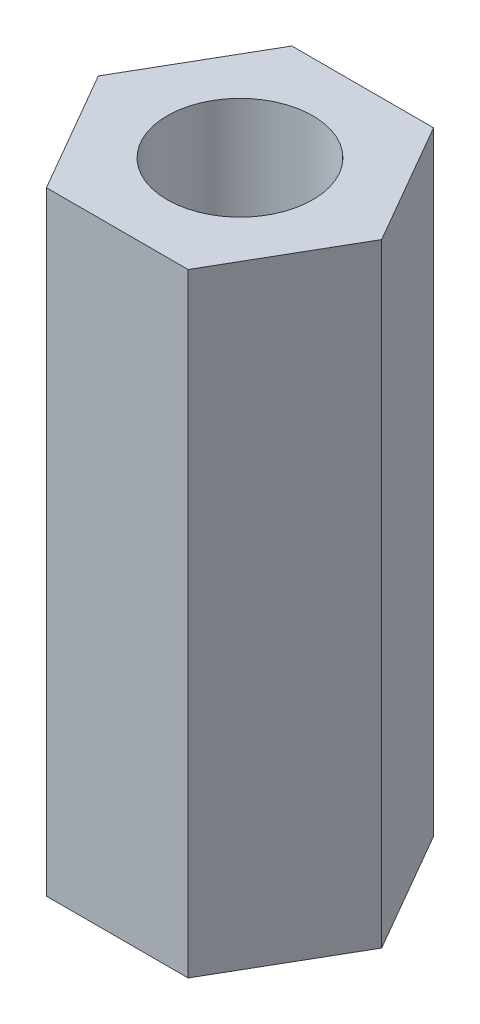
ISO-10303-21;
HEADER;
FILE_DESCRIPTION(('STEP AP214'),'2;1');
FILE_NAME('part.step','',(''),(''),'','','');
FILE_SCHEMA(('AUTOMOTIVE_DESIGN { 1 0 10303 214 1 1 1 1 }'));
ENDSEC;
DATA;
#1=APPLICATION_CONTEXT('core data for automotive mechanical design processes');
#2=APPLICATION_PROTOCOL_DEFINITION('international standard','automotive_design',2000,#1);
#3=PRODUCT_CONTEXT('',#1,'mechanical');
#4=PRODUCT('Part','Part','',(#3));
#5=PRODUCT_RELATED_PRODUCT_CATEGORY('part','',(#4));
#6=PRODUCT_DEFINITION_FORMATION('','',#4);
#7=PRODUCT_DEFINITION_CONTEXT('part definition',#1,'design');
#8=PRODUCT_DEFINITION('design','',#6,#7);
#9=PRODUCT_DEFINITION_SHAPE('','',#8);
#10=(LENGTH_UNIT() NAMED_UNIT(*) SI_UNIT(.MILLI.,.METRE.));
#11=(NAMED_UNIT(*) PLANE_ANGLE_UNIT() SI_UNIT($,.RADIAN.));
#12=(NAMED_UNIT(*) SI_UNIT($,.STERADIAN.) SOLID_ANGLE_UNIT());
#13=UNCERTAINTY_MEASURE_WITH_UNIT(LENGTH_MEASURE(1.E-05),#10,'distance_accuracy_value','');
#14=(GEOMETRIC_REPRESENTATION_CONTEXT(3) GLOBAL_UNCERTAINTY_ASSIGNED_CONTEXT((#13)) GLOBAL_UNIT_ASSIGNED_CONTEXT((#10,
#11,#12)) REPRESENTATION_CONTEXT('',''));
#15=CARTESIAN_POINT('',(0.,0.,0.));
#16=DIRECTION('',(0.,0.,1.));
#17=DIRECTION('',(1.,0.,0.));
#18=AXIS2_PLACEMENT_3D('',#15,#16,#17);
#19=CARTESIAN_POINT('',(0.,9.525,0.));
#20=DIRECTION('',(0.,1.,0.));
#21=DIRECTION('',(0.,0.,1.));
#22=AXIS2_PLACEMENT_3D('',#19,#20,#21);
#23=PLANE('',#22);
#24=DIRECTION('',(1.,0.,0.));
#25=VECTOR('',#24,1.);
#26=CARTESIAN_POINT('',(-1.09985226280624,9.525,1.905));
#27=LINE('',#26,#25);
#28=CARTESIAN_POINT('',(-1.09985226280624,9.525,1.905));
#29=VERTEX_POINT('',#28);
#30=CARTESIAN_POINT('',(1.09985226280624,9.525,1.905));
#31=VERTEX_POINT('',#30);
#32=EDGE_CURVE('E129',#29,#31,#27,.T.);
#33=ORIENTED_EDGE('',*,*,#32,.T.);
#34=DIRECTION('',(0.5,0.,-0.866025403784439));
#35=VECTOR('',#34,1.);
#36=CARTESIAN_POINT('',(1.09985226280624,9.525,1.905));
#37=LINE('',#36,#35);
#38=CARTESIAN_POINT('',(2.19970452561247,9.525,0.));
#39=VERTEX_POINT('',#38);
#40=EDGE_CURVE('E87',#31,#39,#37,.T.);
#41=ORIENTED_EDGE('',*,*,#40,.T.);
#42=DIRECTION('',(-0.5,0.,-0.866025403784439));
#43=VECTOR('',#42,1.);
#44=CARTESIAN_POINT('',(2.19970452561247,9.525,0.));
#45=LINE('',#44,#43);
#46=CARTESIAN_POINT('',(1.09985226280624,9.525,-1.905));
#47=VERTEX_POINT('',#46);
#48=EDGE_CURVE('E100',#39,#47,#45,.T.);
#49=ORIENTED_EDGE('',*,*,#48,.T.);
#50=DIRECTION('',(-1.,0.,0.));
#51=VECTOR('',#50,1.);
#52=CARTESIAN_POINT('',(1.09985226280624,9.525,-1.905));
#53=LINE('',#52,#51);
#54=CARTESIAN_POINT('',(-1.09985226280624,9.525,-1.905));
#55=VERTEX_POINT('',#54);
#56=EDGE_CURVE('E94',#47,#55,#53,.T.);
#57=ORIENTED_EDGE('',*,*,#56,.T.);
#58=DIRECTION('',(-0.5,0.,0.866025403784439));
#59=VECTOR('',#58,1.);
#60=CARTESIAN_POINT('',(-1.09985226280624,9.525,-1.905));
#61=LINE('',#60,#59);
#62=CARTESIAN_POINT('',(-2.19970452561247,9.525,0.));
#63=VERTEX_POINT('',#62);
#64=EDGE_CURVE('E98',#55,#63,#61,.T.);
#65=ORIENTED_EDGE('',*,*,#64,.T.);
#66=DIRECTION('',(0.5,0.,0.866025403784439));
#67=VECTOR('',#66,1.);
#68=CARTESIAN_POINT('',(-2.19970452561247,9.525,0.));
#69=LINE('',#68,#67);
#70=EDGE_CURVE('E50',#63,#29,#69,.T.);
#71=ORIENTED_EDGE('',*,*,#70,.T.);
#72=EDGE_LOOP('',(#33,#41,#49,#57,#65,#71));
#73=FACE_BOUND('',#72,.T.);
#74=CARTESIAN_POINT('',(0.,9.525,0.));
#75=DIRECTION('',(0.,1.,0.));
#76=DIRECTION('',(0.,0.,1.));
#77=AXIS2_PLACEMENT_3D('',#74,#75,#76);
#78=CIRCLE('',#77,1.1303);
#79=CARTESIAN_POINT('',(0.,9.525,1.1303));
#80=VERTEX_POINT('',#79);
#81=EDGE_CURVE('E122',#80,#80,#78,.T.);
#82=ORIENTED_EDGE('',*,*,#81,.F.);
#83=EDGE_LOOP('',(#82));
#84=FACE_BOUND('',#83,.T.);
#85=ADVANCED_FACE('F33',(#73,#84),#23,.T.);
#86=CARTESIAN_POINT('',(0.,0.,0.));
#87=DIRECTION('',(0.,1.,0.));
#88=DIRECTION('',(0.,0.,1.));
#89=AXIS2_PLACEMENT_3D('',#86,#87,#88);
#90=PLANE('',#89);
#91=DIRECTION('',(1.,0.,0.));
#92=VECTOR('',#91,1.);
#93=CARTESIAN_POINT('',(-1.09985226280624,0.,1.905));
#94=LINE('',#93,#92);
#95=CARTESIAN_POINT('',(-1.09985226280624,0.,1.905));
#96=VERTEX_POINT('',#95);
#97=CARTESIAN_POINT('',(1.09985226280624,0.,1.905));
#98=VERTEX_POINT('',#97);
#99=EDGE_CURVE('E118',#96,#98,#94,.T.);
#100=ORIENTED_EDGE('',*,*,#99,.F.);
#101=DIRECTION('',(0.5,0.,0.866025403784439));
#102=VECTOR('',#101,1.);
#103=CARTESIAN_POINT('',(-2.19970452561247,0.,0.));
#104=LINE('',#103,#102);
#105=CARTESIAN_POINT('',(-2.19970452561247,0.,0.));
#106=VERTEX_POINT('',#105);
#107=EDGE_CURVE('E79',#106,#96,#104,.T.);
#108=ORIENTED_EDGE('',*,*,#107,.F.);
#109=DIRECTION('',(-0.5,0.,0.866025403784439));
#110=VECTOR('',#109,1.);
#111=CARTESIAN_POINT('',(-1.09985226280624,0.,-1.905));
#112=LINE('',#111,#110);
#113=CARTESIAN_POINT('',(-1.09985226280624,0.,-1.905));
#114=VERTEX_POINT('',#113);
#115=EDGE_CURVE('E73',#114,#106,#112,.T.);
#116=ORIENTED_EDGE('',*,*,#115,.F.);
#117=DIRECTION('',(-1.,0.,0.));
#118=VECTOR('',#117,1.);
#119=CARTESIAN_POINT('',(1.09985226280624,0.,-1.905));
#120=LINE('',#119,#118);
#121=CARTESIAN_POINT('',(1.09985226280624,0.,-1.905));
#122=VERTEX_POINT('',#121);
#123=EDGE_CURVE('E108',#122,#114,#120,.T.);
#124=ORIENTED_EDGE('',*,*,#123,.F.);
#125=DIRECTION('',(-0.5,0.,-0.866025403784439));
#126=VECTOR('',#125,1.);
#127=CARTESIAN_POINT('',(2.19970452561247,0.,0.));
#128=LINE('',#127,#126);
#129=CARTESIAN_POINT('',(2.19970452561247,0.,0.));
#130=VERTEX_POINT('',#129);
#131=EDGE_CURVE('E124',#130,#122,#128,.T.);
#132=ORIENTED_EDGE('',*,*,#131,.F.);
#133=DIRECTION('',(0.5,0.,-0.866025403784439));
#134=VECTOR('',#133,1.);
#135=CARTESIAN_POINT('',(1.09985226280624,0.,1.905));
#136=LINE('',#135,#134);
#137=EDGE_CURVE('E121',#98,#130,#136,.T.);
#138=ORIENTED_EDGE('',*,*,#137,.F.);
#139=EDGE_LOOP('',(#100,#108,#116,#124,#132,#138));
#140=FACE_BOUND('',#139,.T.);
#141=CARTESIAN_POINT('',(0.,0.,0.));
#142=DIRECTION('',(0.,1.,0.));
#143=DIRECTION('',(0.,0.,1.));
#144=AXIS2_PLACEMENT_3D('',#141,#142,#143);
#145=CIRCLE('',#144,1.1303);
#146=CARTESIAN_POINT('',(0.,0.,1.1303));
#147=VERTEX_POINT('',#146);
#148=EDGE_CURVE('E222',#147,#147,#145,.T.);
#149=ORIENTED_EDGE('',*,*,#148,.T.);
#150=EDGE_LOOP('',(#149));
#151=FACE_BOUND('',#150,.T.);
#152=ADVANCED_FACE('F138',(#140,#151),#90,.F.);
#153=CARTESIAN_POINT('',(-1.09985226280624,9.525,1.905));
#154=DIRECTION('',(0.,0.,-1.));
#155=DIRECTION('',(-1.,0.,0.));
#156=AXIS2_PLACEMENT_3D('',#153,#154,#155);
#157=PLANE('',#156);
#158=ORIENTED_EDGE('',*,*,#99,.T.);
#159=DIRECTION('',(0.,-1.,0.));
#160=VECTOR('',#159,1.);
#161=CARTESIAN_POINT('',(1.09985226280624,9.525,1.905));
#162=LINE('',#161,#160);
#163=EDGE_CURVE('E11',#31,#98,#162,.T.);
#164=ORIENTED_EDGE('',*,*,#163,.F.);
#165=ORIENTED_EDGE('',*,*,#32,.F.);
#166=DIRECTION('',(0.,-1.,0.));
#167=VECTOR('',#166,1.);
#168=CARTESIAN_POINT('',(-1.09985226280624,9.525,1.905));
#169=LINE('',#168,#167);
#170=EDGE_CURVE('E114',#29,#96,#169,.T.);
#171=ORIENTED_EDGE('',*,*,#170,.T.);
#172=EDGE_LOOP('',(#158,#164,#165,#171));
#173=FACE_BOUND('',#172,.T.);
#174=ADVANCED_FACE('F35',(#173),#157,.F.);
#175=CARTESIAN_POINT('',(1.09985226280624,9.525,1.905));
#176=DIRECTION('',(-0.866025403784439,0.,-0.5));
#177=DIRECTION('',(-0.5,0.,0.866025403784439));
#178=AXIS2_PLACEMENT_3D('',#175,#176,#177);
#179=PLANE('',#178);
#180=ORIENTED_EDGE('',*,*,#137,.T.);
#181=DIRECTION('',(0.,-1.,0.));
#182=VECTOR('',#181,1.);
#183=CARTESIAN_POINT('',(2.19970452561247,9.525,0.));
#184=LINE('',#183,#182);
#185=EDGE_CURVE('E42',#39,#130,#184,.T.);
#186=ORIENTED_EDGE('',*,*,#185,.F.);
#187=ORIENTED_EDGE('',*,*,#40,.F.);
#188=ORIENTED_EDGE('',*,*,#163,.T.);
#189=EDGE_LOOP('',(#180,#186,#187,#188));
#190=FACE_BOUND('',#189,.T.);
#191=ADVANCED_FACE('F163',(#190),#179,.F.);
#192=CARTESIAN_POINT('',(2.19970452561247,9.525,0.));
#193=DIRECTION('',(-0.866025403784439,0.,0.5));
#194=DIRECTION('',(0.5,0.,0.866025403784439));
#195=AXIS2_PLACEMENT_3D('',#192,#193,#194);
#196=PLANE('',#195);
#197=ORIENTED_EDGE('',*,*,#131,.T.);
#198=DIRECTION('',(0.,-1.,0.));
#199=VECTOR('',#198,1.);
#200=CARTESIAN_POINT('',(1.09985226280624,9.525,-1.905));
#201=LINE('',#200,#199);
#202=EDGE_CURVE('E109',#47,#122,#201,.T.);
#203=ORIENTED_EDGE('',*,*,#202,.F.);
#204=ORIENTED_EDGE('',*,*,#48,.F.);
#205=ORIENTED_EDGE('',*,*,#185,.T.);
#206=EDGE_LOOP('',(#197,#203,#204,#205));
#207=FACE_BOUND('',#206,.T.);
#208=ADVANCED_FACE('F135',(#207),#196,.F.);
#209=CARTESIAN_POINT('',(1.09985226280624,9.525,-1.905));
#210=DIRECTION('',(0.,0.,1.));
#211=DIRECTION('',(1.,0.,0.));
#212=AXIS2_PLACEMENT_3D('',#209,#210,#211);
#213=PLANE('',#212);
#214=ORIENTED_EDGE('',*,*,#123,.T.);
#215=DIRECTION('',(0.,-1.,0.));
#216=VECTOR('',#215,1.);
#217=CARTESIAN_POINT('',(-1.09985226280624,9.525,-1.905));
#218=LINE('',#217,#216);
#219=EDGE_CURVE('E105',#55,#114,#218,.T.);
#220=ORIENTED_EDGE('',*,*,#219,.F.);
#221=ORIENTED_EDGE('',*,*,#56,.F.);
#222=ORIENTED_EDGE('',*,*,#202,.T.);
#223=EDGE_LOOP('',(#214,#220,#221,#222));
#224=FACE_BOUND('',#223,.T.);
#225=ADVANCED_FACE('F106',(#224),#213,.F.);
#226=CARTESIAN_POINT('',(-1.09985226280624,9.525,-1.905));
#227=DIRECTION('',(0.866025403784439,0.,0.5));
#228=DIRECTION('',(0.5,0.,-0.866025403784439));
#229=AXIS2_PLACEMENT_3D('',#226,#227,#228);
#230=PLANE('',#229);
#231=ORIENTED_EDGE('',*,*,#115,.T.);
#232=DIRECTION('',(0.,-1.,0.));
#233=VECTOR('',#232,1.);
#234=CARTESIAN_POINT('',(-2.19970452561247,9.525,0.));
#235=LINE('',#234,#233);
#236=EDGE_CURVE('E110',#63,#106,#235,.T.);
#237=ORIENTED_EDGE('',*,*,#236,.F.);
#238=ORIENTED_EDGE('',*,*,#64,.F.);
#239=ORIENTED_EDGE('',*,*,#219,.T.);
#240=EDGE_LOOP('',(#231,#237,#238,#239));
#241=FACE_BOUND('',#240,.T.);
#242=ADVANCED_FACE('F112',(#241),#230,.F.);
#243=CARTESIAN_POINT('',(-2.19970452561247,9.525,0.));
#244=DIRECTION('',(0.866025403784439,0.,-0.5));
#245=DIRECTION('',(-0.5,0.,-0.866025403784439));
#246=AXIS2_PLACEMENT_3D('',#243,#244,#245);
#247=PLANE('',#246);
#248=ORIENTED_EDGE('',*,*,#107,.T.);
#249=ORIENTED_EDGE('',*,*,#170,.F.);
#250=ORIENTED_EDGE('',*,*,#70,.F.);
#251=ORIENTED_EDGE('',*,*,#236,.T.);
#252=EDGE_LOOP('',(#248,#249,#250,#251));
#253=FACE_BOUND('',#252,.T.);
#254=ADVANCED_FACE('F143',(#253),#247,.F.);
#255=CARTESIAN_POINT('',(0.,9.525,0.));
#256=DIRECTION('',(0.,-1.,0.));
#257=DIRECTION('',(0.,0.,-1.));
#258=AXIS2_PLACEMENT_3D('',#255,#256,#257);
#259=CYLINDRICAL_SURFACE('',#258,1.1303);
#260=ORIENTED_EDGE('',*,*,#81,.T.);
#261=EDGE_LOOP('',(#260));
#262=FACE_BOUND('',#261,.T.);
#263=ORIENTED_EDGE('',*,*,#148,.F.);
#264=EDGE_LOOP('',(#263));
#265=FACE_BOUND('',#264,.T.);
#266=ADVANCED_FACE('F145',(#262,#265),#259,.F.);
#267=CLOSED_SHELL('',(#85,#152,#174,#191,#208,#225,#242,#254,#266));
#268=MANIFOLD_SOLID_BREP('B2',#267);
#269=ADVANCED_BREP_SHAPE_REPRESENTATION('',(#18,#268),#14);
#270=SHAPE_DEFINITION_REPRESENTATION(#9,#269);
ENDSEC;
END-ISO-10303-21;
